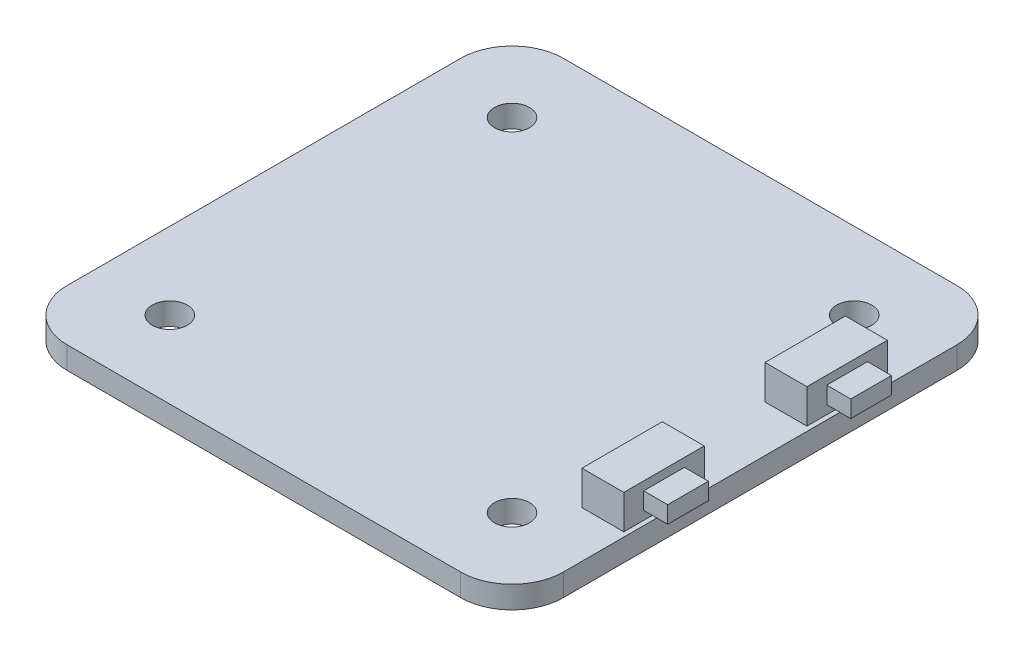
ISO-10303-21;
HEADER;
FILE_DESCRIPTION(('STEP AP214'),'2;1');
FILE_NAME('part.step','',(''),(''),'','','');
FILE_SCHEMA(('AUTOMOTIVE_DESIGN { 1 0 10303 214 1 1 1 1 }'));
ENDSEC;
DATA;
#1=APPLICATION_CONTEXT('core data for automotive mechanical design processes');
#2=APPLICATION_PROTOCOL_DEFINITION('international standard','automotive_design',2000,#1);
#3=PRODUCT_CONTEXT('',#1,'mechanical');
#4=PRODUCT('Part','Part','',(#3));
#5=PRODUCT_RELATED_PRODUCT_CATEGORY('part','',(#4));
#6=PRODUCT_DEFINITION_FORMATION('','',#4);
#7=PRODUCT_DEFINITION_CONTEXT('part definition',#1,'design');
#8=PRODUCT_DEFINITION('design','',#6,#7);
#9=PRODUCT_DEFINITION_SHAPE('','',#8);
#10=(LENGTH_UNIT() NAMED_UNIT(*) SI_UNIT(.MILLI.,.METRE.));
#11=(NAMED_UNIT(*) PLANE_ANGLE_UNIT() SI_UNIT($,.RADIAN.));
#12=(NAMED_UNIT(*) SI_UNIT($,.STERADIAN.) SOLID_ANGLE_UNIT());
#13=UNCERTAINTY_MEASURE_WITH_UNIT(LENGTH_MEASURE(1.E-05),#10,'distance_accuracy_value','');
#14=(GEOMETRIC_REPRESENTATION_CONTEXT(3) GLOBAL_UNCERTAINTY_ASSIGNED_CONTEXT((#13)) GLOBAL_UNIT_ASSIGNED_CONTEXT((#10,
#11,#12)) REPRESENTATION_CONTEXT('',''));
#15=CARTESIAN_POINT('',(0.,0.,0.));
#16=DIRECTION('',(0.,0.,1.));
#17=DIRECTION('',(1.,0.,0.));
#18=AXIS2_PLACEMENT_3D('',#15,#16,#17);
#19=CARTESIAN_POINT('',(28.7369669535864,3.3,-22.2));
#20=DIRECTION('',(-1.,0.,0.));
#21=DIRECTION('',(0.,0.,1.));
#22=AXIS2_PLACEMENT_3D('',#19,#20,#21);
#23=PLANE('',#22);
#24=DIRECTION('',(0.,0.,-1.));
#25=VECTOR('',#24,1.);
#26=CARTESIAN_POINT('',(28.7369669535864,1.3,-22.2));
#27=LINE('',#26,#25);
#28=CARTESIAN_POINT('',(28.7369669535864,1.3,-17.5));
#29=VERTEX_POINT('',#28);
#30=CARTESIAN_POINT('',(28.7369669535864,1.3,-22.2));
#31=VERTEX_POINT('',#30);
#32=EDGE_CURVE('E286',#29,#31,#27,.T.);
#33=ORIENTED_EDGE('',*,*,#32,.T.);
#34=DIRECTION('',(0.,-1.,0.));
#35=VECTOR('',#34,1.);
#36=CARTESIAN_POINT('',(28.7369669535864,3.3,-22.2));
#37=LINE('',#36,#35);
#38=CARTESIAN_POINT('',(28.7369669535864,3.3,-22.2));
#39=VERTEX_POINT('',#38);
#40=EDGE_CURVE('E316',#39,#31,#37,.T.);
#41=ORIENTED_EDGE('',*,*,#40,.F.);
#42=DIRECTION('',(0.,0.,-1.));
#43=VECTOR('',#42,1.);
#44=CARTESIAN_POINT('',(28.7369669535864,3.3,-22.2));
#45=LINE('',#44,#43);
#46=CARTESIAN_POINT('',(28.7369669535864,3.3,-17.5));
#47=VERTEX_POINT('',#46);
#48=EDGE_CURVE('E287',#47,#39,#45,.T.);
#49=ORIENTED_EDGE('',*,*,#48,.F.);
#50=DIRECTION('',(0.,-1.,0.));
#51=VECTOR('',#50,1.);
#52=CARTESIAN_POINT('',(28.7369669535864,3.3,-17.5));
#53=LINE('',#52,#51);
#54=EDGE_CURVE('E297',#47,#29,#53,.T.);
#55=ORIENTED_EDGE('',*,*,#54,.T.);
#56=EDGE_LOOP('',(#33,#41,#49,#55));
#57=FACE_BOUND('',#56,.T.);
#58=DIRECTION('',(0.,0.,1.));
#59=VECTOR('',#58,1.);
#60=CARTESIAN_POINT('',(28.7369669535864,2.7957208151052,-21.039063913614));
#61=LINE('',#60,#59);
#62=CARTESIAN_POINT('',(28.7369669535864,2.7957208151052,-21.039063913614));
#63=VERTEX_POINT('',#62);
#64=CARTESIAN_POINT('',(28.7369669535864,2.7957208151052,-18.660936086386));
#65=VERTEX_POINT('',#64);
#66=EDGE_CURVE('E214',#63,#65,#61,.T.);
#67=ORIENTED_EDGE('',*,*,#66,.F.);
#68=DIRECTION('',(0.,1.,0.));
#69=VECTOR('',#68,1.);
#70=CARTESIAN_POINT('',(28.7369669535864,2.7957208151052,-21.039063913614));
#71=LINE('',#70,#69);
#72=CARTESIAN_POINT('',(28.7369669535864,1.8042791848948,-21.039063913614));
#73=VERTEX_POINT('',#72);
#74=EDGE_CURVE('E211',#73,#63,#71,.T.);
#75=ORIENTED_EDGE('',*,*,#74,.F.);
#76=DIRECTION('',(0.,0.,-1.));
#77=VECTOR('',#76,1.);
#78=CARTESIAN_POINT('',(28.7369669535864,1.8042791848948,-21.039063913614));
#79=LINE('',#78,#77);
#80=CARTESIAN_POINT('',(28.7369669535864,1.8042791848948,-18.660936086386));
#81=VERTEX_POINT('',#80);
#82=EDGE_CURVE('E53',#81,#73,#79,.T.);
#83=ORIENTED_EDGE('',*,*,#82,.F.);
#84=DIRECTION('',(0.,-1.,0.));
#85=VECTOR('',#84,1.);
#86=CARTESIAN_POINT('',(28.7369669535864,2.7957208151052,-18.660936086386));
#87=LINE('',#86,#85);
#88=EDGE_CURVE('E48',#65,#81,#87,.T.);
#89=ORIENTED_EDGE('',*,*,#88,.F.);
#90=EDGE_LOOP('',(#67,#75,#83,#89));
#91=FACE_BOUND('',#90,.T.);
#92=ADVANCED_FACE('F33',(#57,#91),#23,.F.);
#93=CARTESIAN_POINT('',(28.7369669535864,3.3,-6.8));
#94=DIRECTION('',(-1.,0.,0.));
#95=DIRECTION('',(0.,0.,1.));
#96=AXIS2_PLACEMENT_3D('',#93,#94,#95);
#97=PLANE('',#96);
#98=DIRECTION('',(0.,0.,-1.));
#99=VECTOR('',#98,1.);
#100=CARTESIAN_POINT('',(28.7369669535864,1.3,-6.8));
#101=LINE('',#100,#99);
#102=CARTESIAN_POINT('',(28.7369669535864,1.3,-6.80000000000001));
#103=VERTEX_POINT('',#102);
#104=CARTESIAN_POINT('',(28.7369669535864,1.3,-11.5));
#105=VERTEX_POINT('',#104);
#106=EDGE_CURVE('E267',#103,#105,#101,.T.);
#107=ORIENTED_EDGE('',*,*,#106,.T.);
#108=DIRECTION('',(0.,-1.,0.));
#109=VECTOR('',#108,1.);
#110=CARTESIAN_POINT('',(28.7369669535864,3.3,-11.5));
#111=LINE('',#110,#109);
#112=CARTESIAN_POINT('',(28.7369669535864,3.3,-11.5));
#113=VERTEX_POINT('',#112);
#114=EDGE_CURVE('E280',#113,#105,#111,.T.);
#115=ORIENTED_EDGE('',*,*,#114,.F.);
#116=DIRECTION('',(0.,0.,-1.));
#117=VECTOR('',#116,1.);
#118=CARTESIAN_POINT('',(28.7369669535864,3.3,-6.8));
#119=LINE('',#118,#117);
#120=CARTESIAN_POINT('',(28.7369669535864,3.3,-6.8));
#121=VERTEX_POINT('',#120);
#122=EDGE_CURVE('E257',#121,#113,#119,.T.);
#123=ORIENTED_EDGE('',*,*,#122,.F.);
#124=DIRECTION('',(0.,-1.,0.));
#125=VECTOR('',#124,1.);
#126=CARTESIAN_POINT('',(28.7369669535864,3.3,-6.8));
#127=LINE('',#126,#125);
#128=EDGE_CURVE('E283',#121,#103,#127,.T.);
#129=ORIENTED_EDGE('',*,*,#128,.T.);
#130=EDGE_LOOP('',(#107,#115,#123,#129));
#131=FACE_BOUND('',#130,.T.);
#132=DIRECTION('',(0.,-1.,0.));
#133=VECTOR('',#132,1.);
#134=CARTESIAN_POINT('',(28.7369669535864,2.7957208151052,-7.96093608638602));
#135=LINE('',#134,#133);
#136=CARTESIAN_POINT('',(28.7369669535864,2.7957208151052,-7.96093608638602));
#137=VERTEX_POINT('',#136);
#138=CARTESIAN_POINT('',(28.7369669535864,1.8042791848948,-7.96093608638602));
#139=VERTEX_POINT('',#138);
#140=EDGE_CURVE('E215',#137,#139,#135,.T.);
#141=ORIENTED_EDGE('',*,*,#140,.F.);
#142=DIRECTION('',(0.,0.,1.));
#143=VECTOR('',#142,1.);
#144=CARTESIAN_POINT('',(28.7369669535864,2.7957208151052,-7.96093608638602));
#145=LINE('',#144,#143);
#146=CARTESIAN_POINT('',(28.7369669535864,2.7957208151052,-10.339063913614));
#147=VERTEX_POINT('',#146);
#148=EDGE_CURVE('E228',#147,#137,#145,.T.);
#149=ORIENTED_EDGE('',*,*,#148,.F.);
#150=DIRECTION('',(0.,1.,0.));
#151=VECTOR('',#150,1.);
#152=CARTESIAN_POINT('',(28.7369669535864,2.7957208151052,-10.339063913614));
#153=LINE('',#152,#151);
#154=CARTESIAN_POINT('',(28.7369669535864,1.8042791848948,-10.339063913614));
#155=VERTEX_POINT('',#154);
#156=EDGE_CURVE('E237',#155,#147,#153,.T.);
#157=ORIENTED_EDGE('',*,*,#156,.F.);
#158=DIRECTION('',(0.,0.,-1.));
#159=VECTOR('',#158,1.);
#160=CARTESIAN_POINT('',(28.7369669535864,1.8042791848948,-7.96093608638602));
#161=LINE('',#160,#159);
#162=EDGE_CURVE('E218',#139,#155,#161,.T.);
#163=ORIENTED_EDGE('',*,*,#162,.F.);
#164=EDGE_LOOP('',(#141,#149,#157,#163));
#165=FACE_BOUND('',#164,.T.);
#166=ADVANCED_FACE('F447',(#131,#165),#97,.F.);
#167=CARTESIAN_POINT('',(26.,1.3,-26.));
#168=DIRECTION('',(0.,-1.,0.));
#169=DIRECTION('',(0.,0.,-1.));
#170=AXIS2_PLACEMENT_3D('',#167,#168,#169);
#171=PLANE('',#170);
#172=ORIENTED_EDGE('',*,*,#32,.F.);
#173=DIRECTION('',(1.,0.,0.));
#174=VECTOR('',#173,1.);
#175=CARTESIAN_POINT('',(28.7369669535864,1.3,-17.5));
#176=LINE('',#175,#174);
#177=CARTESIAN_POINT('',(26.2869669535864,1.3,-17.5));
#178=VERTEX_POINT('',#177);
#179=EDGE_CURVE('E291',#178,#29,#176,.T.);
#180=ORIENTED_EDGE('',*,*,#179,.F.);
#181=DIRECTION('',(0.,0.,1.));
#182=VECTOR('',#181,1.);
#183=CARTESIAN_POINT('',(26.2869669535864,1.3,-22.2));
#184=LINE('',#183,#182);
#185=CARTESIAN_POINT('',(26.2869669535864,1.3,-22.2));
#186=VERTEX_POINT('',#185);
#187=EDGE_CURVE('E303',#186,#178,#184,.T.);
#188=ORIENTED_EDGE('',*,*,#187,.F.);
#189=DIRECTION('',(-1.,0.,0.));
#190=VECTOR('',#189,1.);
#191=CARTESIAN_POINT('',(28.7369669535864,1.3,-22.2));
#192=LINE('',#191,#190);
#193=EDGE_CURVE('E300',#31,#186,#192,.T.);
#194=ORIENTED_EDGE('',*,*,#193,.F.);
#195=EDGE_LOOP('',(#172,#180,#188,#194));
#196=FACE_BOUND('',#195,.T.);
#197=CARTESIAN_POINT('',(26.,1.3,-26.));
#198=DIRECTION('',(0.,1.,0.));
#199=DIRECTION('',(0.,0.,-1.));
#200=AXIS2_PLACEMENT_3D('',#197,#198,#199);
#201=CIRCLE('',#200,3.);
#202=CARTESIAN_POINT('',(29.,1.3,-26.));
#203=VERTEX_POINT('',#202);
#204=CARTESIAN_POINT('',(26.,1.3,-29.));
#205=VERTEX_POINT('',#204);
#206=EDGE_CURVE('E344',#203,#205,#201,.T.);
#207=ORIENTED_EDGE('',*,*,#206,.T.);
#208=DIRECTION('',(-1.,0.,0.));
#209=VECTOR('',#208,1.);
#210=CARTESIAN_POINT('',(3.00000000000002,1.3,-29.));
#211=LINE('',#210,#209);
#212=CARTESIAN_POINT('',(3.00000000000002,1.3,-29.));
#213=VERTEX_POINT('',#212);
#214=EDGE_CURVE('E347',#205,#213,#211,.T.);
#215=ORIENTED_EDGE('',*,*,#214,.T.);
#216=CARTESIAN_POINT('',(2.99999999999999,1.3,-26.));
#217=DIRECTION('',(0.,1.,0.));
#218=DIRECTION('',(0.,0.,-1.));
#219=AXIS2_PLACEMENT_3D('',#216,#217,#218);
#220=CIRCLE('',#219,3.);
#221=CARTESIAN_POINT('',(0.,1.3,-26.));
#222=VERTEX_POINT('',#221);
#223=EDGE_CURVE('E350',#213,#222,#220,.T.);
#224=ORIENTED_EDGE('',*,*,#223,.T.);
#225=DIRECTION('',(0.,0.,1.));
#226=VECTOR('',#225,1.);
#227=CARTESIAN_POINT('',(0.,1.3,-3.00000000000002));
#228=LINE('',#227,#226);
#229=CARTESIAN_POINT('',(0.,1.3,-3.00000000000002));
#230=VERTEX_POINT('',#229);
#231=EDGE_CURVE('E352',#222,#230,#228,.T.);
#232=ORIENTED_EDGE('',*,*,#231,.T.);
#233=CARTESIAN_POINT('',(3.,1.3,-3.));
#234=DIRECTION('',(0.,1.,0.));
#235=DIRECTION('',(0.,0.,-1.));
#236=AXIS2_PLACEMENT_3D('',#233,#234,#235);
#237=CIRCLE('',#236,3.);
#238=CARTESIAN_POINT('',(3.00000000000002,1.3,0.));
#239=VERTEX_POINT('',#238);
#240=EDGE_CURVE('E354',#230,#239,#237,.T.);
#241=ORIENTED_EDGE('',*,*,#240,.T.);
#242=DIRECTION('',(1.,0.,0.));
#243=VECTOR('',#242,1.);
#244=CARTESIAN_POINT('',(3.00000000000002,1.3,0.));
#245=LINE('',#244,#243);
#246=CARTESIAN_POINT('',(26.,1.3,0.));
#247=VERTEX_POINT('',#246);
#248=EDGE_CURVE('E356',#239,#247,#245,.T.);
#249=ORIENTED_EDGE('',*,*,#248,.T.);
#250=CARTESIAN_POINT('',(26.,1.3,-3.));
#251=DIRECTION('',(0.,1.,0.));
#252=DIRECTION('',(0.,0.,1.));
#253=AXIS2_PLACEMENT_3D('',#250,#251,#252);
#254=CIRCLE('',#253,3.);
#255=CARTESIAN_POINT('',(29.,1.3,-3.00000000000002));
#256=VERTEX_POINT('',#255);
#257=EDGE_CURVE('E358',#247,#256,#254,.T.);
#258=ORIENTED_EDGE('',*,*,#257,.T.);
#259=DIRECTION('',(0.,0.,-1.));
#260=VECTOR('',#259,1.);
#261=CARTESIAN_POINT('',(29.,1.3,-3.00000000000002));
#262=LINE('',#261,#260);
#263=EDGE_CURVE('E360',#256,#203,#262,.T.);
#264=ORIENTED_EDGE('',*,*,#263,.T.);
#265=EDGE_LOOP('',(#207,#215,#224,#232,#241,#249,#258,#264));
#266=FACE_BOUND('',#265,.T.);
#267=CARTESIAN_POINT('',(4.49999999999999,1.3,-24.5));
#268=DIRECTION('',(0.,1.,0.));
#269=DIRECTION('',(0.,0.,1.));
#270=AXIS2_PLACEMENT_3D('',#267,#268,#269);
#271=CIRCLE('',#270,1.025);
#272=CARTESIAN_POINT('',(4.49999999999999,1.3,-23.475));
#273=VERTEX_POINT('',#272);
#274=EDGE_CURVE('E338',#273,#273,#271,.T.);
#275=ORIENTED_EDGE('',*,*,#274,.F.);
#276=EDGE_LOOP('',(#275));
#277=FACE_BOUND('',#276,.T.);
#278=CARTESIAN_POINT('',(24.5,1.3,-24.5));
#279=DIRECTION('',(0.,1.,0.));
#280=DIRECTION('',(0.,0.,1.));
#281=AXIS2_PLACEMENT_3D('',#278,#279,#280);
#282=CIRCLE('',#281,1.025);
#283=CARTESIAN_POINT('',(24.5,1.3,-23.475));
#284=VERTEX_POINT('',#283);
#285=EDGE_CURVE('E332',#284,#284,#282,.T.);
#286=ORIENTED_EDGE('',*,*,#285,.F.);
#287=EDGE_LOOP('',(#286));
#288=FACE_BOUND('',#287,.T.);
#289=CARTESIAN_POINT('',(24.5000000000002,1.3,-4.5));
#290=DIRECTION('',(0.,1.,0.));
#291=DIRECTION('',(0.,0.,1.));
#292=AXIS2_PLACEMENT_3D('',#289,#290,#291);
#293=CIRCLE('',#292,1.025);
#294=CARTESIAN_POINT('',(24.5000000000002,1.3,-3.475));
#295=VERTEX_POINT('',#294);
#296=EDGE_CURVE('E326',#295,#295,#293,.T.);
#297=ORIENTED_EDGE('',*,*,#296,.F.);
#298=EDGE_LOOP('',(#297));
#299=FACE_BOUND('',#298,.T.);
#300=CARTESIAN_POINT('',(4.5000000000002,1.3,-4.5));
#301=DIRECTION('',(0.,1.,0.));
#302=DIRECTION('',(0.,0.,1.));
#303=AXIS2_PLACEMENT_3D('',#300,#301,#302);
#304=CIRCLE('',#303,1.025);
#305=CARTESIAN_POINT('',(4.5000000000002,1.3,-3.475));
#306=VERTEX_POINT('',#305);
#307=EDGE_CURVE('E320',#306,#306,#304,.T.);
#308=ORIENTED_EDGE('',*,*,#307,.F.);
#309=EDGE_LOOP('',(#308));
#310=FACE_BOUND('',#309,.T.);
#311=DIRECTION('',(1.,0.,0.));
#312=VECTOR('',#311,1.);
#313=CARTESIAN_POINT('',(28.7369669535864,1.3,-6.8));
#314=LINE('',#313,#312);
#315=CARTESIAN_POINT('',(26.2869669535864,1.3,-6.8));
#316=VERTEX_POINT('',#315);
#317=EDGE_CURVE('E253',#316,#103,#314,.T.);
#318=ORIENTED_EDGE('',*,*,#317,.F.);
#319=DIRECTION('',(0.,0.,1.));
#320=VECTOR('',#319,1.);
#321=CARTESIAN_POINT('',(26.2869669535864,1.3,-6.8));
#322=LINE('',#321,#320);
#323=CARTESIAN_POINT('',(26.2869669535864,1.3,-11.5));
#324=VERTEX_POINT('',#323);
#325=EDGE_CURVE('E258',#324,#316,#322,.T.);
#326=ORIENTED_EDGE('',*,*,#325,.F.);
#327=DIRECTION('',(-1.,0.,0.));
#328=VECTOR('',#327,1.);
#329=CARTESIAN_POINT('',(28.7369669535864,1.3,-11.5));
#330=LINE('',#329,#328);
#331=EDGE_CURVE('E270',#105,#324,#330,.T.);
#332=ORIENTED_EDGE('',*,*,#331,.F.);
#333=ORIENTED_EDGE('',*,*,#106,.F.);
#334=EDGE_LOOP('',(#318,#326,#332,#333));
#335=FACE_BOUND('',#334,.T.);
#336=ADVANCED_FACE('F419',(#196,#266,#277,#288,#299,#310,#335),#171,.F.);
#337=CARTESIAN_POINT('',(26.,0.,-26.));
#338=DIRECTION('',(0.,-1.,0.));
#339=DIRECTION('',(0.,0.,-1.));
#340=AXIS2_PLACEMENT_3D('',#337,#338,#339);
#341=PLANE('',#340);
#342=CARTESIAN_POINT('',(24.5000000000002,0.,-4.5));
#343=DIRECTION('',(0.,1.,0.));
#344=DIRECTION('',(0.,0.,1.));
#345=AXIS2_PLACEMENT_3D('',#342,#343,#344);
#346=CIRCLE('',#345,1.025);
#347=CARTESIAN_POINT('',(24.5000000000002,0.,-3.475));
#348=VERTEX_POINT('',#347);
#349=EDGE_CURVE('E323',#348,#348,#346,.T.);
#350=ORIENTED_EDGE('',*,*,#349,.T.);
#351=EDGE_LOOP('',(#350));
#352=FACE_BOUND('',#351,.T.);
#353=CARTESIAN_POINT('',(4.49999999999999,0.,-24.5));
#354=DIRECTION('',(0.,1.,0.));
#355=DIRECTION('',(0.,0.,1.));
#356=AXIS2_PLACEMENT_3D('',#353,#354,#355);
#357=CIRCLE('',#356,1.025);
#358=CARTESIAN_POINT('',(4.49999999999999,0.,-23.475));
#359=VERTEX_POINT('',#358);
#360=EDGE_CURVE('E335',#359,#359,#357,.T.);
#361=ORIENTED_EDGE('',*,*,#360,.T.);
#362=EDGE_LOOP('',(#361));
#363=FACE_BOUND('',#362,.T.);
#364=CARTESIAN_POINT('',(26.,0.,-26.));
#365=DIRECTION('',(0.,1.,0.));
#366=DIRECTION('',(0.,0.,-1.));
#367=AXIS2_PLACEMENT_3D('',#364,#365,#366);
#368=CIRCLE('',#367,3.);
#369=CARTESIAN_POINT('',(29.,0.,-26.));
#370=VERTEX_POINT('',#369);
#371=CARTESIAN_POINT('',(26.,0.,-29.));
#372=VERTEX_POINT('',#371);
#373=EDGE_CURVE('E341',#370,#372,#368,.T.);
#374=ORIENTED_EDGE('',*,*,#373,.F.);
#375=DIRECTION('',(0.,0.,-1.));
#376=VECTOR('',#375,1.);
#377=CARTESIAN_POINT('',(29.,0.,-3.00000000000002));
#378=LINE('',#377,#376);
#379=CARTESIAN_POINT('',(29.,0.,-3.00000000000002));
#380=VERTEX_POINT('',#379);
#381=EDGE_CURVE('E348',#380,#370,#378,.T.);
#382=ORIENTED_EDGE('',*,*,#381,.F.);
#383=CARTESIAN_POINT('',(26.,0.,-3.));
#384=DIRECTION('',(0.,1.,0.));
#385=DIRECTION('',(0.,0.,1.));
#386=AXIS2_PLACEMENT_3D('',#383,#384,#385);
#387=CIRCLE('',#386,3.);
#388=CARTESIAN_POINT('',(26.,0.,0.));
#389=VERTEX_POINT('',#388);
#390=EDGE_CURVE('E375',#389,#380,#387,.T.);
#391=ORIENTED_EDGE('',*,*,#390,.F.);
#392=DIRECTION('',(1.,0.,0.));
#393=VECTOR('',#392,1.);
#394=CARTESIAN_POINT('',(3.00000000000002,0.,0.));
#395=LINE('',#394,#393);
#396=CARTESIAN_POINT('',(3.00000000000002,0.,0.));
#397=VERTEX_POINT('',#396);
#398=EDGE_CURVE('E373',#397,#389,#395,.T.);
#399=ORIENTED_EDGE('',*,*,#398,.F.);
#400=CARTESIAN_POINT('',(3.,0.,-3.));
#401=DIRECTION('',(0.,1.,0.));
#402=DIRECTION('',(0.,0.,-1.));
#403=AXIS2_PLACEMENT_3D('',#400,#401,#402);
#404=CIRCLE('',#403,3.);
#405=CARTESIAN_POINT('',(0.,0.,-3.00000000000002));
#406=VERTEX_POINT('',#405);
#407=EDGE_CURVE('E371',#406,#397,#404,.T.);
#408=ORIENTED_EDGE('',*,*,#407,.F.);
#409=DIRECTION('',(0.,0.,1.));
#410=VECTOR('',#409,1.);
#411=CARTESIAN_POINT('',(0.,0.,-3.00000000000002));
#412=LINE('',#411,#410);
#413=CARTESIAN_POINT('',(0.,0.,-26.));
#414=VERTEX_POINT('',#413);
#415=EDGE_CURVE('E369',#414,#406,#412,.T.);
#416=ORIENTED_EDGE('',*,*,#415,.F.);
#417=CARTESIAN_POINT('',(2.99999999999999,0.,-26.));
#418=DIRECTION('',(0.,1.,0.));
#419=DIRECTION('',(0.,0.,-1.));
#420=AXIS2_PLACEMENT_3D('',#417,#418,#419);
#421=CIRCLE('',#420,3.);
#422=CARTESIAN_POINT('',(3.00000000000002,0.,-29.));
#423=VERTEX_POINT('',#422);
#424=EDGE_CURVE('E367',#423,#414,#421,.T.);
#425=ORIENTED_EDGE('',*,*,#424,.F.);
#426=DIRECTION('',(-1.,0.,0.));
#427=VECTOR('',#426,1.);
#428=CARTESIAN_POINT('',(3.00000000000002,0.,-29.));
#429=LINE('',#428,#427);
#430=EDGE_CURVE('E365',#372,#423,#429,.T.);
#431=ORIENTED_EDGE('',*,*,#430,.F.);
#432=EDGE_LOOP('',(#374,#382,#391,#399,#408,#416,#425,#431));
#433=FACE_BOUND('',#432,.T.);
#434=CARTESIAN_POINT('',(24.5,0.,-24.5));
#435=DIRECTION('',(0.,1.,0.));
#436=DIRECTION('',(0.,0.,1.));
#437=AXIS2_PLACEMENT_3D('',#434,#435,#436);
#438=CIRCLE('',#437,1.025);
#439=CARTESIAN_POINT('',(24.5,0.,-23.475));
#440=VERTEX_POINT('',#439);
#441=EDGE_CURVE('E329',#440,#440,#438,.T.);
#442=ORIENTED_EDGE('',*,*,#441,.T.);
#443=EDGE_LOOP('',(#442));
#444=FACE_BOUND('',#443,.T.);
#445=CARTESIAN_POINT('',(4.5000000000002,0.,-4.5));
#446=DIRECTION('',(0.,1.,0.));
#447=DIRECTION('',(0.,0.,1.));
#448=AXIS2_PLACEMENT_3D('',#445,#446,#447);
#449=CIRCLE('',#448,1.025);
#450=CARTESIAN_POINT('',(4.5000000000002,0.,-3.475));
#451=VERTEX_POINT('',#450);
#452=EDGE_CURVE('E319',#451,#451,#449,.T.);
#453=ORIENTED_EDGE('',*,*,#452,.T.);
#454=EDGE_LOOP('',(#453));
#455=FACE_BOUND('',#454,.T.);
#456=ADVANCED_FACE('F405',(#352,#363,#433,#444,#455),#341,.T.);
#457=CARTESIAN_POINT('',(26.,1.3,-26.));
#458=DIRECTION('',(0.,-1.,0.));
#459=DIRECTION('',(0.,0.,-1.));
#460=AXIS2_PLACEMENT_3D('',#457,#458,#459);
#461=CYLINDRICAL_SURFACE('',#460,3.);
#462=ORIENTED_EDGE('',*,*,#373,.T.);
#463=DIRECTION('',(0.,-1.,0.));
#464=VECTOR('',#463,1.);
#465=CARTESIAN_POINT('',(26.,1.3,-29.));
#466=LINE('',#465,#464);
#467=EDGE_CURVE('E11',#205,#372,#466,.T.);
#468=ORIENTED_EDGE('',*,*,#467,.F.);
#469=ORIENTED_EDGE('',*,*,#206,.F.);
#470=DIRECTION('',(0.,-1.,0.));
#471=VECTOR('',#470,1.);
#472=CARTESIAN_POINT('',(29.,1.3,-26.));
#473=LINE('',#472,#471);
#474=EDGE_CURVE('E362',#203,#370,#473,.T.);
#475=ORIENTED_EDGE('',*,*,#474,.T.);
#476=EDGE_LOOP('',(#462,#468,#469,#475));
#477=FACE_BOUND('',#476,.T.);
#478=ADVANCED_FACE('F35',(#477),#461,.T.);
#479=CARTESIAN_POINT('',(3.00000000000002,1.3,-29.));
#480=DIRECTION('',(0.,0.,1.));
#481=DIRECTION('',(1.,0.,0.));
#482=AXIS2_PLACEMENT_3D('',#479,#480,#481);
#483=PLANE('',#482);
#484=ORIENTED_EDGE('',*,*,#430,.T.);
#485=DIRECTION('',(0.,-1.,0.));
#486=VECTOR('',#485,1.);
#487=CARTESIAN_POINT('',(3.00000000000002,1.3,-29.));
#488=LINE('',#487,#486);
#489=EDGE_CURVE('E41',#213,#423,#488,.T.);
#490=ORIENTED_EDGE('',*,*,#489,.F.);
#491=ORIENTED_EDGE('',*,*,#214,.F.);
#492=ORIENTED_EDGE('',*,*,#467,.T.);
#493=EDGE_LOOP('',(#484,#490,#491,#492));
#494=FACE_BOUND('',#493,.T.);
#495=ADVANCED_FACE('F424',(#494),#483,.F.);
#496=CARTESIAN_POINT('',(2.99999999999999,1.3,-26.));
#497=DIRECTION('',(0.,-1.,0.));
#498=DIRECTION('',(0.,0.,-1.));
#499=AXIS2_PLACEMENT_3D('',#496,#497,#498);
#500=CYLINDRICAL_SURFACE('',#499,3.);
#501=ORIENTED_EDGE('',*,*,#424,.T.);
#502=DIRECTION('',(0.,-1.,0.));
#503=VECTOR('',#502,1.);
#504=CARTESIAN_POINT('',(0.,1.3,-26.));
#505=LINE('',#504,#503);
#506=EDGE_CURVE('E392',#222,#414,#505,.T.);
#507=ORIENTED_EDGE('',*,*,#506,.F.);
#508=ORIENTED_EDGE('',*,*,#223,.F.);
#509=ORIENTED_EDGE('',*,*,#489,.T.);
#510=EDGE_LOOP('',(#501,#507,#508,#509));
#511=FACE_BOUND('',#510,.T.);
#512=ADVANCED_FACE('F399',(#511),#500,.T.);
#513=CARTESIAN_POINT('',(0.,1.3,-3.00000000000002));
#514=DIRECTION('',(1.,0.,0.));
#515=DIRECTION('',(0.,0.,-1.));
#516=AXIS2_PLACEMENT_3D('',#513,#514,#515);
#517=PLANE('',#516);
#518=ORIENTED_EDGE('',*,*,#415,.T.);
#519=DIRECTION('',(0.,-1.,0.));
#520=VECTOR('',#519,1.);
#521=CARTESIAN_POINT('',(0.,1.3,-3.00000000000002));
#522=LINE('',#521,#520);
#523=EDGE_CURVE('E389',#230,#406,#522,.T.);
#524=ORIENTED_EDGE('',*,*,#523,.F.);
#525=ORIENTED_EDGE('',*,*,#231,.F.);
#526=ORIENTED_EDGE('',*,*,#506,.T.);
#527=EDGE_LOOP('',(#518,#524,#525,#526));
#528=FACE_BOUND('',#527,.T.);
#529=ADVANCED_FACE('F411',(#528),#517,.F.);
#530=CARTESIAN_POINT('',(3.,1.3,-3.));
#531=DIRECTION('',(0.,-1.,0.));
#532=DIRECTION('',(0.,0.,-1.));
#533=AXIS2_PLACEMENT_3D('',#530,#531,#532);
#534=CYLINDRICAL_SURFACE('',#533,3.);
#535=ORIENTED_EDGE('',*,*,#407,.T.);
#536=DIRECTION('',(0.,-1.,0.));
#537=VECTOR('',#536,1.);
#538=CARTESIAN_POINT('',(3.00000000000002,1.3,0.));
#539=LINE('',#538,#537);
#540=EDGE_CURVE('E386',#239,#397,#539,.T.);
#541=ORIENTED_EDGE('',*,*,#540,.F.);
#542=ORIENTED_EDGE('',*,*,#240,.F.);
#543=ORIENTED_EDGE('',*,*,#523,.T.);
#544=EDGE_LOOP('',(#535,#541,#542,#543));
#545=FACE_BOUND('',#544,.T.);
#546=ADVANCED_FACE('F415',(#545),#534,.T.);
#547=CARTESIAN_POINT('',(3.00000000000002,1.3,0.));
#548=DIRECTION('',(0.,0.,-1.));
#549=DIRECTION('',(-1.,0.,0.));
#550=AXIS2_PLACEMENT_3D('',#547,#548,#549);
#551=PLANE('',#550);
#552=ORIENTED_EDGE('',*,*,#398,.T.);
#553=DIRECTION('',(0.,-1.,0.));
#554=VECTOR('',#553,1.);
#555=CARTESIAN_POINT('',(26.,1.3,0.));
#556=LINE('',#555,#554);
#557=EDGE_CURVE('E383',#247,#389,#556,.T.);
#558=ORIENTED_EDGE('',*,*,#557,.F.);
#559=ORIENTED_EDGE('',*,*,#248,.F.);
#560=ORIENTED_EDGE('',*,*,#540,.T.);
#561=EDGE_LOOP('',(#552,#558,#559,#560));
#562=FACE_BOUND('',#561,.T.);
#563=ADVANCED_FACE('F437',(#562),#551,.F.);
#564=CARTESIAN_POINT('',(26.,1.3,-3.));
#565=DIRECTION('',(0.,-1.,0.));
#566=DIRECTION('',(0.,0.,-1.));
#567=AXIS2_PLACEMENT_3D('',#564,#565,#566);
#568=CYLINDRICAL_SURFACE('',#567,3.);
#569=ORIENTED_EDGE('',*,*,#390,.T.);
#570=DIRECTION('',(0.,-1.,0.));
#571=VECTOR('',#570,1.);
#572=CARTESIAN_POINT('',(29.,1.3,-3.00000000000002));
#573=LINE('',#572,#571);
#574=EDGE_CURVE('E380',#256,#380,#573,.T.);
#575=ORIENTED_EDGE('',*,*,#574,.F.);
#576=ORIENTED_EDGE('',*,*,#257,.F.);
#577=ORIENTED_EDGE('',*,*,#557,.T.);
#578=EDGE_LOOP('',(#569,#575,#576,#577));
#579=FACE_BOUND('',#578,.T.);
#580=ADVANCED_FACE('F435',(#579),#568,.T.);
#581=CARTESIAN_POINT('',(29.,1.3,-3.00000000000002));
#582=DIRECTION('',(-1.,0.,0.));
#583=DIRECTION('',(0.,0.,1.));
#584=AXIS2_PLACEMENT_3D('',#581,#582,#583);
#585=PLANE('',#584);
#586=ORIENTED_EDGE('',*,*,#381,.T.);
#587=ORIENTED_EDGE('',*,*,#474,.F.);
#588=ORIENTED_EDGE('',*,*,#263,.F.);
#589=ORIENTED_EDGE('',*,*,#574,.T.);
#590=EDGE_LOOP('',(#586,#587,#588,#589));
#591=FACE_BOUND('',#590,.T.);
#592=ADVANCED_FACE('F430',(#591),#585,.F.);
#593=CARTESIAN_POINT('',(4.49999999999999,1.3,-24.5));
#594=DIRECTION('',(0.,-1.,0.));
#595=DIRECTION('',(0.,0.,-1.));
#596=AXIS2_PLACEMENT_3D('',#593,#594,#595);
#597=CYLINDRICAL_SURFACE('',#596,1.025);
#598=ORIENTED_EDGE('',*,*,#274,.T.);
#599=EDGE_LOOP('',(#598));
#600=FACE_BOUND('',#599,.T.);
#601=ORIENTED_EDGE('',*,*,#360,.F.);
#602=EDGE_LOOP('',(#601));
#603=FACE_BOUND('',#602,.T.);
#604=ADVANCED_FACE('F470',(#600,#603),#597,.F.);
#605=CARTESIAN_POINT('',(24.5,1.3,-24.5));
#606=DIRECTION('',(0.,-1.,0.));
#607=DIRECTION('',(0.,0.,-1.));
#608=AXIS2_PLACEMENT_3D('',#605,#606,#607);
#609=CYLINDRICAL_SURFACE('',#608,1.025);
#610=ORIENTED_EDGE('',*,*,#285,.T.);
#611=EDGE_LOOP('',(#610));
#612=FACE_BOUND('',#611,.T.);
#613=ORIENTED_EDGE('',*,*,#441,.F.);
#614=EDGE_LOOP('',(#613));
#615=FACE_BOUND('',#614,.T.);
#616=ADVANCED_FACE('F466',(#612,#615),#609,.F.);
#617=CARTESIAN_POINT('',(24.5000000000002,1.3,-4.5));
#618=DIRECTION('',(0.,-1.,0.));
#619=DIRECTION('',(0.,0.,-1.));
#620=AXIS2_PLACEMENT_3D('',#617,#618,#619);
#621=CYLINDRICAL_SURFACE('',#620,1.025);
#622=ORIENTED_EDGE('',*,*,#296,.T.);
#623=EDGE_LOOP('',(#622));
#624=FACE_BOUND('',#623,.T.);
#625=ORIENTED_EDGE('',*,*,#349,.F.);
#626=EDGE_LOOP('',(#625));
#627=FACE_BOUND('',#626,.T.);
#628=ADVANCED_FACE('F462',(#624,#627),#621,.F.);
#629=CARTESIAN_POINT('',(4.5000000000002,1.3,-4.5));
#630=DIRECTION('',(0.,-1.,0.));
#631=DIRECTION('',(0.,0.,-1.));
#632=AXIS2_PLACEMENT_3D('',#629,#630,#631);
#633=CYLINDRICAL_SURFACE('',#632,1.025);
#634=ORIENTED_EDGE('',*,*,#307,.T.);
#635=EDGE_LOOP('',(#634));
#636=FACE_BOUND('',#635,.T.);
#637=ORIENTED_EDGE('',*,*,#452,.F.);
#638=EDGE_LOOP('',(#637));
#639=FACE_BOUND('',#638,.T.);
#640=ADVANCED_FACE('F459',(#636,#639),#633,.F.);
#641=CARTESIAN_POINT('',(28.7369669535864,3.3,-22.2));
#642=DIRECTION('',(0.,0.,1.));
#643=DIRECTION('',(1.,0.,0.));
#644=AXIS2_PLACEMENT_3D('',#641,#642,#643);
#645=PLANE('',#644);
#646=ORIENTED_EDGE('',*,*,#193,.T.);
#647=DIRECTION('',(0.,-1.,0.));
#648=VECTOR('',#647,1.);
#649=CARTESIAN_POINT('',(26.2869669535864,3.3,-22.2));
#650=LINE('',#649,#648);
#651=CARTESIAN_POINT('',(26.2869669535864,3.3,-22.2));
#652=VERTEX_POINT('',#651);
#653=EDGE_CURVE('E313',#652,#186,#650,.T.);
#654=ORIENTED_EDGE('',*,*,#653,.F.);
#655=DIRECTION('',(-1.,0.,0.));
#656=VECTOR('',#655,1.);
#657=CARTESIAN_POINT('',(28.7369669535864,3.3,-22.2));
#658=LINE('',#657,#656);
#659=EDGE_CURVE('E290',#39,#652,#658,.T.);
#660=ORIENTED_EDGE('',*,*,#659,.F.);
#661=ORIENTED_EDGE('',*,*,#40,.T.);
#662=EDGE_LOOP('',(#646,#654,#660,#661));
#663=FACE_BOUND('',#662,.T.);
#664=ADVANCED_FACE('F457',(#663),#645,.F.);
#665=CARTESIAN_POINT('',(26.2869669535864,3.3,-22.2));
#666=DIRECTION('',(1.,0.,0.));
#667=DIRECTION('',(0.,0.,-1.));
#668=AXIS2_PLACEMENT_3D('',#665,#666,#667);
#669=PLANE('',#668);
#670=ORIENTED_EDGE('',*,*,#187,.T.);
#671=DIRECTION('',(0.,-1.,0.));
#672=VECTOR('',#671,1.);
#673=CARTESIAN_POINT('',(26.2869669535864,3.3,-17.5));
#674=LINE('',#673,#672);
#675=CARTESIAN_POINT('',(26.2869669535864,3.3,-17.5));
#676=VERTEX_POINT('',#675);
#677=EDGE_CURVE('E310',#676,#178,#674,.T.);
#678=ORIENTED_EDGE('',*,*,#677,.F.);
#679=DIRECTION('',(0.,0.,1.));
#680=VECTOR('',#679,1.);
#681=CARTESIAN_POINT('',(26.2869669535864,3.3,-22.2));
#682=LINE('',#681,#680);
#683=EDGE_CURVE('E293',#652,#676,#682,.T.);
#684=ORIENTED_EDGE('',*,*,#683,.F.);
#685=ORIENTED_EDGE('',*,*,#653,.T.);
#686=EDGE_LOOP('',(#670,#678,#684,#685));
#687=FACE_BOUND('',#686,.T.);
#688=ADVANCED_FACE('F509',(#687),#669,.F.);
#689=CARTESIAN_POINT('',(28.7369669535864,3.3,-17.5));
#690=DIRECTION('',(0.,0.,-1.));
#691=DIRECTION('',(-1.,0.,0.));
#692=AXIS2_PLACEMENT_3D('',#689,#690,#691);
#693=PLANE('',#692);
#694=ORIENTED_EDGE('',*,*,#179,.T.);
#695=ORIENTED_EDGE('',*,*,#54,.F.);
#696=DIRECTION('',(1.,0.,0.));
#697=VECTOR('',#696,1.);
#698=CARTESIAN_POINT('',(28.7369669535864,3.3,-17.5));
#699=LINE('',#698,#697);
#700=EDGE_CURVE('E295',#676,#47,#699,.T.);
#701=ORIENTED_EDGE('',*,*,#700,.F.);
#702=ORIENTED_EDGE('',*,*,#677,.T.);
#703=EDGE_LOOP('',(#694,#695,#701,#702));
#704=FACE_BOUND('',#703,.T.);
#705=ADVANCED_FACE('F516',(#704),#693,.F.);
#706=CARTESIAN_POINT('',(0.,3.3,0.));
#707=DIRECTION('',(0.,-1.,0.));
#708=DIRECTION('',(0.,0.,-1.));
#709=AXIS2_PLACEMENT_3D('',#706,#707,#708);
#710=PLANE('',#709);
#711=ORIENTED_EDGE('',*,*,#48,.T.);
#712=ORIENTED_EDGE('',*,*,#659,.T.);
#713=ORIENTED_EDGE('',*,*,#683,.T.);
#714=ORIENTED_EDGE('',*,*,#700,.T.);
#715=EDGE_LOOP('',(#711,#712,#713,#714));
#716=FACE_BOUND('',#715,.T.);
#717=ADVANCED_FACE('F523',(#716),#710,.F.);
#718=CARTESIAN_POINT('',(28.7369669535864,3.3,-6.8));
#719=DIRECTION('',(0.,0.,-1.));
#720=DIRECTION('',(-1.,0.,0.));
#721=AXIS2_PLACEMENT_3D('',#718,#719,#720);
#722=PLANE('',#721);
#723=ORIENTED_EDGE('',*,*,#317,.T.);
#724=ORIENTED_EDGE('',*,*,#128,.F.);
#725=DIRECTION('',(1.,0.,0.));
#726=VECTOR('',#725,1.);
#727=CARTESIAN_POINT('',(28.7369669535864,3.3,-6.8));
#728=LINE('',#727,#726);
#729=CARTESIAN_POINT('',(26.2869669535864,3.3,-6.8));
#730=VERTEX_POINT('',#729);
#731=EDGE_CURVE('E254',#730,#121,#728,.T.);
#732=ORIENTED_EDGE('',*,*,#731,.F.);
#733=DIRECTION('',(0.,-1.,0.));
#734=VECTOR('',#733,1.);
#735=CARTESIAN_POINT('',(26.2869669535864,3.3,-6.8));
#736=LINE('',#735,#734);
#737=EDGE_CURVE('E264',#730,#316,#736,.T.);
#738=ORIENTED_EDGE('',*,*,#737,.T.);
#739=EDGE_LOOP('',(#723,#724,#732,#738));
#740=FACE_BOUND('',#739,.T.);
#741=ADVANCED_FACE('F531',(#740),#722,.F.);
#742=CARTESIAN_POINT('',(28.7369669535864,3.3,-11.5));
#743=DIRECTION('',(0.,0.,1.));
#744=DIRECTION('',(1.,0.,0.));
#745=AXIS2_PLACEMENT_3D('',#742,#743,#744);
#746=PLANE('',#745);
#747=ORIENTED_EDGE('',*,*,#331,.T.);
#748=DIRECTION('',(0.,-1.,0.));
#749=VECTOR('',#748,1.);
#750=CARTESIAN_POINT('',(26.2869669535864,3.3,-11.5));
#751=LINE('',#750,#749);
#752=CARTESIAN_POINT('',(26.2869669535864,3.3,-11.5));
#753=VERTEX_POINT('',#752);
#754=EDGE_CURVE('E277',#753,#324,#751,.T.);
#755=ORIENTED_EDGE('',*,*,#754,.F.);
#756=DIRECTION('',(-1.,0.,0.));
#757=VECTOR('',#756,1.);
#758=CARTESIAN_POINT('',(28.7369669535864,3.3,-11.5));
#759=LINE('',#758,#757);
#760=EDGE_CURVE('E260',#113,#753,#759,.T.);
#761=ORIENTED_EDGE('',*,*,#760,.F.);
#762=ORIENTED_EDGE('',*,*,#114,.T.);
#763=EDGE_LOOP('',(#747,#755,#761,#762));
#764=FACE_BOUND('',#763,.T.);
#765=ADVANCED_FACE('F539',(#764),#746,.F.);
#766=CARTESIAN_POINT('',(26.2869669535864,3.3,-6.8));
#767=DIRECTION('',(1.,0.,0.));
#768=DIRECTION('',(0.,0.,-1.));
#769=AXIS2_PLACEMENT_3D('',#766,#767,#768);
#770=PLANE('',#769);
#771=ORIENTED_EDGE('',*,*,#325,.T.);
#772=ORIENTED_EDGE('',*,*,#737,.F.);
#773=DIRECTION('',(0.,0.,1.));
#774=VECTOR('',#773,1.);
#775=CARTESIAN_POINT('',(26.2869669535864,3.3,-6.8));
#776=LINE('',#775,#774);
#777=EDGE_CURVE('E262',#753,#730,#776,.T.);
#778=ORIENTED_EDGE('',*,*,#777,.F.);
#779=ORIENTED_EDGE('',*,*,#754,.T.);
#780=EDGE_LOOP('',(#771,#772,#778,#779));
#781=FACE_BOUND('',#780,.T.);
#782=ADVANCED_FACE('F547',(#781),#770,.F.);
#783=CARTESIAN_POINT('',(0.,3.3,0.));
#784=DIRECTION('',(0.,-1.,0.));
#785=DIRECTION('',(0.,0.,-1.));
#786=AXIS2_PLACEMENT_3D('',#783,#784,#785);
#787=PLANE('',#786);
#788=ORIENTED_EDGE('',*,*,#731,.T.);
#789=ORIENTED_EDGE('',*,*,#122,.T.);
#790=ORIENTED_EDGE('',*,*,#760,.T.);
#791=ORIENTED_EDGE('',*,*,#777,.T.);
#792=EDGE_LOOP('',(#788,#789,#790,#791));
#793=FACE_BOUND('',#792,.T.);
#794=ADVANCED_FACE('F555',(#793),#787,.F.);
#795=CARTESIAN_POINT('',(30.1369669535864,2.7957208151052,-7.96093608638602));
#796=DIRECTION('',(0.,0.,-1.));
#797=DIRECTION('',(-1.,0.,0.));
#798=AXIS2_PLACEMENT_3D('',#795,#796,#797);
#799=PLANE('',#798);
#800=ORIENTED_EDGE('',*,*,#140,.T.);
#801=DIRECTION('',(-1.,0.,0.));
#802=VECTOR('',#801,1.);
#803=CARTESIAN_POINT('',(30.1369669535864,1.8042791848948,-7.96093608638602));
#804=LINE('',#803,#802);
#805=CARTESIAN_POINT('',(30.1369669535864,1.8042791848948,-7.96093608638602));
#806=VERTEX_POINT('',#805);
#807=EDGE_CURVE('E250',#806,#139,#804,.T.);
#808=ORIENTED_EDGE('',*,*,#807,.F.);
#809=DIRECTION('',(0.,-1.,0.));
#810=VECTOR('',#809,1.);
#811=CARTESIAN_POINT('',(30.1369669535864,2.7957208151052,-7.96093608638602));
#812=LINE('',#811,#810);
#813=CARTESIAN_POINT('',(30.1369669535864,2.7957208151052,-7.96093608638602));
#814=VERTEX_POINT('',#813);
#815=EDGE_CURVE('E224',#814,#806,#812,.T.);
#816=ORIENTED_EDGE('',*,*,#815,.F.);
#817=DIRECTION('',(-1.,0.,0.));
#818=VECTOR('',#817,1.);
#819=CARTESIAN_POINT('',(30.1369669535864,2.7957208151052,-7.96093608638602));
#820=LINE('',#819,#818);
#821=EDGE_CURVE('E233',#814,#137,#820,.T.);
#822=ORIENTED_EDGE('',*,*,#821,.T.);
#823=EDGE_LOOP('',(#800,#808,#816,#822));
#824=FACE_BOUND('',#823,.T.);
#825=ADVANCED_FACE('F563',(#824),#799,.F.);
#826=CARTESIAN_POINT('',(30.1369669535864,1.8042791848948,-7.96093608638602));
#827=DIRECTION('',(0.,1.,0.));
#828=DIRECTION('',(0.,0.,1.));
#829=AXIS2_PLACEMENT_3D('',#826,#827,#828);
#830=PLANE('',#829);
#831=ORIENTED_EDGE('',*,*,#162,.T.);
#832=DIRECTION('',(-1.,0.,0.));
#833=VECTOR('',#832,1.);
#834=CARTESIAN_POINT('',(30.1369669535864,1.8042791848948,-10.339063913614));
#835=LINE('',#834,#833);
#836=CARTESIAN_POINT('',(30.1369669535864,1.8042791848948,-10.339063913614));
#837=VERTEX_POINT('',#836);
#838=EDGE_CURVE('E247',#837,#155,#835,.T.);
#839=ORIENTED_EDGE('',*,*,#838,.F.);
#840=DIRECTION('',(0.,0.,-1.));
#841=VECTOR('',#840,1.);
#842=CARTESIAN_POINT('',(30.1369669535864,1.8042791848948,-7.96093608638602));
#843=LINE('',#842,#841);
#844=EDGE_CURVE('E227',#806,#837,#843,.T.);
#845=ORIENTED_EDGE('',*,*,#844,.F.);
#846=ORIENTED_EDGE('',*,*,#807,.T.);
#847=EDGE_LOOP('',(#831,#839,#845,#846));
#848=FACE_BOUND('',#847,.T.);
#849=ADVANCED_FACE('F571',(#848),#830,.F.);
#850=CARTESIAN_POINT('',(30.1369669535864,2.7957208151052,-10.339063913614));
#851=DIRECTION('',(0.,0.,1.));
#852=DIRECTION('',(1.,0.,0.));
#853=AXIS2_PLACEMENT_3D('',#850,#851,#852);
#854=PLANE('',#853);
#855=ORIENTED_EDGE('',*,*,#156,.T.);
#856=DIRECTION('',(-1.,0.,0.));
#857=VECTOR('',#856,1.);
#858=CARTESIAN_POINT('',(30.1369669535864,2.7957208151052,-10.339063913614));
#859=LINE('',#858,#857);
#860=CARTESIAN_POINT('',(30.1369669535864,2.7957208151052,-10.339063913614));
#861=VERTEX_POINT('',#860);
#862=EDGE_CURVE('E244',#861,#147,#859,.T.);
#863=ORIENTED_EDGE('',*,*,#862,.F.);
#864=DIRECTION('',(0.,1.,0.));
#865=VECTOR('',#864,1.);
#866=CARTESIAN_POINT('',(30.1369669535864,2.7957208151052,-10.339063913614));
#867=LINE('',#866,#865);
#868=EDGE_CURVE('E230',#837,#861,#867,.T.);
#869=ORIENTED_EDGE('',*,*,#868,.F.);
#870=ORIENTED_EDGE('',*,*,#838,.T.);
#871=EDGE_LOOP('',(#855,#863,#869,#870));
#872=FACE_BOUND('',#871,.T.);
#873=ADVANCED_FACE('F580',(#872),#854,.F.);
#874=CARTESIAN_POINT('',(30.1369669535864,2.7957208151052,-7.96093608638602));
#875=DIRECTION('',(0.,-1.,0.));
#876=DIRECTION('',(0.,0.,-1.));
#877=AXIS2_PLACEMENT_3D('',#874,#875,#876);
#878=PLANE('',#877);
#879=ORIENTED_EDGE('',*,*,#148,.T.);
#880=ORIENTED_EDGE('',*,*,#821,.F.);
#881=DIRECTION('',(0.,0.,1.));
#882=VECTOR('',#881,1.);
#883=CARTESIAN_POINT('',(30.1369669535864,2.7957208151052,-7.96093608638602));
#884=LINE('',#883,#882);
#885=EDGE_CURVE('E232',#861,#814,#884,.T.);
#886=ORIENTED_EDGE('',*,*,#885,.F.);
#887=ORIENTED_EDGE('',*,*,#862,.T.);
#888=EDGE_LOOP('',(#879,#880,#886,#887));
#889=FACE_BOUND('',#888,.T.);
#890=ADVANCED_FACE('F588',(#889),#878,.F.);
#891=CARTESIAN_POINT('',(30.1369669535864,0.,0.));
#892=DIRECTION('',(1.,0.,0.));
#893=DIRECTION('',(0.,0.,-1.));
#894=AXIS2_PLACEMENT_3D('',#891,#892,#893);
#895=PLANE('',#894);
#896=ORIENTED_EDGE('',*,*,#815,.T.);
#897=ORIENTED_EDGE('',*,*,#844,.T.);
#898=ORIENTED_EDGE('',*,*,#868,.T.);
#899=ORIENTED_EDGE('',*,*,#885,.T.);
#900=EDGE_LOOP('',(#896,#897,#898,#899));
#901=FACE_BOUND('',#900,.T.);
#902=ADVANCED_FACE('F596',(#901),#895,.T.);
#903=CARTESIAN_POINT('',(30.1369669535864,2.7957208151052,-21.039063913614));
#904=DIRECTION('',(0.,-1.,0.));
#905=DIRECTION('',(0.,0.,-1.));
#906=AXIS2_PLACEMENT_3D('',#903,#904,#905);
#907=PLANE('',#906);
#908=ORIENTED_EDGE('',*,*,#66,.T.);
#909=DIRECTION('',(-1.,0.,0.));
#910=VECTOR('',#909,1.);
#911=CARTESIAN_POINT('',(30.1369669535864,2.7957208151052,-18.660936086386));
#912=LINE('',#911,#910);
#913=CARTESIAN_POINT('',(30.1369669535864,2.7957208151052,-18.660936086386));
#914=VERTEX_POINT('',#913);
#915=EDGE_CURVE('E195',#914,#65,#912,.T.);
#916=ORIENTED_EDGE('',*,*,#915,.F.);
#917=DIRECTION('',(0.,0.,1.));
#918=VECTOR('',#917,1.);
#919=CARTESIAN_POINT('',(30.1369669535864,2.7957208151052,-21.039063913614));
#920=LINE('',#919,#918);
#921=CARTESIAN_POINT('',(30.1369669535864,2.7957208151052,-21.039063913614));
#922=VERTEX_POINT('',#921);
#923=EDGE_CURVE('E202',#922,#914,#920,.T.);
#924=ORIENTED_EDGE('',*,*,#923,.F.);
#925=DIRECTION('',(-1.,0.,0.));
#926=VECTOR('',#925,1.);
#927=CARTESIAN_POINT('',(30.1369669535864,2.7957208151052,-21.039063913614));
#928=LINE('',#927,#926);
#929=EDGE_CURVE('E753',#922,#63,#928,.T.);
#930=ORIENTED_EDGE('',*,*,#929,.T.);
#931=EDGE_LOOP('',(#908,#916,#924,#930));
#932=FACE_BOUND('',#931,.T.);
#933=ADVANCED_FACE('F213',(#932),#907,.F.);
#934=CARTESIAN_POINT('',(30.1369669535864,2.7957208151052,-18.660936086386));
#935=DIRECTION('',(0.,0.,-1.));
#936=DIRECTION('',(-1.,0.,0.));
#937=AXIS2_PLACEMENT_3D('',#934,#935,#936);
#938=PLANE('',#937);
#939=ORIENTED_EDGE('',*,*,#88,.T.);
#940=DIRECTION('',(-1.,0.,0.));
#941=VECTOR('',#940,1.);
#942=CARTESIAN_POINT('',(30.1369669535864,1.8042791848948,-18.660936086386));
#943=LINE('',#942,#941);
#944=CARTESIAN_POINT('',(30.1369669535864,1.8042791848948,-18.660936086386));
#945=VERTEX_POINT('',#944);
#946=EDGE_CURVE('E198',#945,#81,#943,.T.);
#947=ORIENTED_EDGE('',*,*,#946,.F.);
#948=DIRECTION('',(0.,-1.,0.));
#949=VECTOR('',#948,1.);
#950=CARTESIAN_POINT('',(30.1369669535864,2.7957208151052,-18.660936086386));
#951=LINE('',#950,#949);
#952=EDGE_CURVE('E191',#914,#945,#951,.T.);
#953=ORIENTED_EDGE('',*,*,#952,.F.);
#954=ORIENTED_EDGE('',*,*,#915,.T.);
#955=EDGE_LOOP('',(#939,#947,#953,#954));
#956=FACE_BOUND('',#955,.T.);
#957=ADVANCED_FACE('F193',(#956),#938,.F.);
#958=CARTESIAN_POINT('',(30.1369669535864,1.8042791848948,-21.039063913614));
#959=DIRECTION('',(0.,1.,0.));
#960=DIRECTION('',(0.,0.,1.));
#961=AXIS2_PLACEMENT_3D('',#958,#959,#960);
#962=PLANE('',#961);
#963=ORIENTED_EDGE('',*,*,#82,.T.);
#964=DIRECTION('',(-1.,0.,0.));
#965=VECTOR('',#964,1.);
#966=CARTESIAN_POINT('',(30.1369669535864,1.8042791848948,-21.039063913614));
#967=LINE('',#966,#965);
#968=CARTESIAN_POINT('',(30.1369669535864,1.8042791848948,-21.039063913614));
#969=VERTEX_POINT('',#968);
#970=EDGE_CURVE('E220',#969,#73,#967,.T.);
#971=ORIENTED_EDGE('',*,*,#970,.F.);
#972=DIRECTION('',(0.,0.,-1.));
#973=VECTOR('',#972,1.);
#974=CARTESIAN_POINT('',(30.1369669535864,1.8042791848948,-21.039063913614));
#975=LINE('',#974,#973);
#976=EDGE_CURVE('E201',#945,#969,#975,.T.);
#977=ORIENTED_EDGE('',*,*,#976,.F.);
#978=ORIENTED_EDGE('',*,*,#946,.T.);
#979=EDGE_LOOP('',(#963,#971,#977,#978));
#980=FACE_BOUND('',#979,.T.);
#981=ADVANCED_FACE('F617',(#980),#962,.F.);
#982=CARTESIAN_POINT('',(30.1369669535864,2.7957208151052,-21.039063913614));
#983=DIRECTION('',(0.,0.,1.));
#984=DIRECTION('',(1.,0.,0.));
#985=AXIS2_PLACEMENT_3D('',#982,#983,#984);
#986=PLANE('',#985);
#987=ORIENTED_EDGE('',*,*,#74,.T.);
#988=ORIENTED_EDGE('',*,*,#929,.F.);
#989=DIRECTION('',(0.,1.,0.));
#990=VECTOR('',#989,1.);
#991=CARTESIAN_POINT('',(30.1369669535864,2.7957208151052,-21.039063913614));
#992=LINE('',#991,#990);
#993=EDGE_CURVE('E207',#969,#922,#992,.T.);
#994=ORIENTED_EDGE('',*,*,#993,.F.);
#995=ORIENTED_EDGE('',*,*,#970,.T.);
#996=EDGE_LOOP('',(#987,#988,#994,#995));
#997=FACE_BOUND('',#996,.T.);
#998=ADVANCED_FACE('F624',(#997),#986,.F.);
#999=CARTESIAN_POINT('',(30.1369669535864,0.,0.));
#1000=DIRECTION('',(1.,0.,0.));
#1001=DIRECTION('',(0.,0.,-1.));
#1002=AXIS2_PLACEMENT_3D('',#999,#1000,#1001);
#1003=PLANE('',#1002);
#1004=ORIENTED_EDGE('',*,*,#923,.T.);
#1005=ORIENTED_EDGE('',*,*,#952,.T.);
#1006=ORIENTED_EDGE('',*,*,#976,.T.);
#1007=ORIENTED_EDGE('',*,*,#993,.T.);
#1008=EDGE_LOOP('',(#1004,#1005,#1006,#1007));
#1009=FACE_BOUND('',#1008,.T.);
#1010=ADVANCED_FACE('F205',(#1009),#1003,.T.);
#1011=CLOSED_SHELL('',(#92,#166,#336,#456,#478,#495,#512,#529,#546,#563,#580,#592,#604,#616,
#628,#640,#664,#688,#705,#717,#741,#765,#782,#794,#825,#849,#873,#890,#902,#933,#957,#981,#998,#1010));
#1012=MANIFOLD_SOLID_BREP('B2',#1011);
#1013=ADVANCED_BREP_SHAPE_REPRESENTATION('',(#18,#1012),#14);
#1014=SHAPE_DEFINITION_REPRESENTATION(#9,#1013);
ENDSEC;
END-ISO-10303-21;
